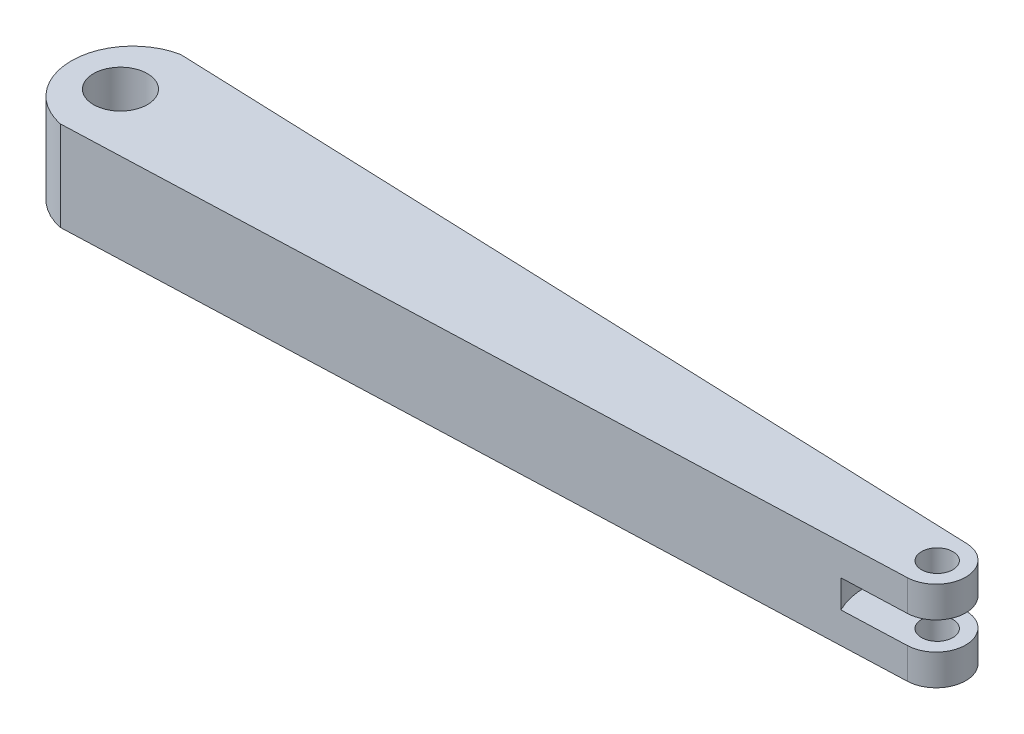
ISO-10303-21;
HEADER;
FILE_DESCRIPTION(('STEP AP214'),'2;1');
FILE_NAME('part.step','',(''),(''),'','','');
FILE_SCHEMA(('AUTOMOTIVE_DESIGN { 1 0 10303 214 1 1 1 1 }'));
ENDSEC;
DATA;
#1=APPLICATION_CONTEXT('core data for automotive mechanical design processes');
#2=APPLICATION_PROTOCOL_DEFINITION('international standard','automotive_design',2000,#1);
#3=PRODUCT_CONTEXT('',#1,'mechanical');
#4=PRODUCT('Part','Part','',(#3));
#5=PRODUCT_RELATED_PRODUCT_CATEGORY('part','',(#4));
#6=PRODUCT_DEFINITION_FORMATION('','',#4);
#7=PRODUCT_DEFINITION_CONTEXT('part definition',#1,'design');
#8=PRODUCT_DEFINITION('design','',#6,#7);
#9=PRODUCT_DEFINITION_SHAPE('','',#8);
#10=(LENGTH_UNIT() NAMED_UNIT(*) SI_UNIT(.MILLI.,.METRE.));
#11=(NAMED_UNIT(*) PLANE_ANGLE_UNIT() SI_UNIT($,.RADIAN.));
#12=(NAMED_UNIT(*) SI_UNIT($,.STERADIAN.) SOLID_ANGLE_UNIT());
#13=UNCERTAINTY_MEASURE_WITH_UNIT(LENGTH_MEASURE(1.E-05),#10,'distance_accuracy_value','');
#14=(GEOMETRIC_REPRESENTATION_CONTEXT(3) GLOBAL_UNCERTAINTY_ASSIGNED_CONTEXT((#13)) GLOBAL_UNIT_ASSIGNED_CONTEXT((#10,
#11,#12)) REPRESENTATION_CONTEXT('',''));
#15=CARTESIAN_POINT('',(0.,0.,0.));
#16=DIRECTION('',(0.,0.,1.));
#17=DIRECTION('',(1.,0.,0.));
#18=AXIS2_PLACEMENT_3D('',#15,#16,#17);
#19=CARTESIAN_POINT('',(66.8275229688345,10.,0.));
#20=DIRECTION('',(0.,-1.,0.));
#21=DIRECTION('',(0.,0.,-1.));
#22=AXIS2_PLACEMENT_3D('',#19,#20,#21);
#23=CYLINDRICAL_SURFACE('',#22,3.30230254171901);
#24=DIRECTION('',(0.,-1.,0.));
#25=VECTOR('',#24,1.);
#26=CARTESIAN_POINT('',(66.9508196721312,10.,3.3));
#27=LINE('',#26,#25);
#28=CARTESIAN_POINT('',(66.9508196721312,10.,3.3));
#29=VERTEX_POINT('',#28);
#30=CARTESIAN_POINT('',(66.9508196721312,6.55,3.3));
#31=VERTEX_POINT('',#30);
#32=EDGE_CURVE('E174',#29,#31,#27,.T.);
#33=ORIENTED_EDGE('',*,*,#32,.T.);
#34=CARTESIAN_POINT('',(66.8275229688345,6.55,0.));
#35=DIRECTION('',(0.,1.,0.));
#36=DIRECTION('',(0.,0.,1.));
#37=AXIS2_PLACEMENT_3D('',#34,#35,#36);
#38=CIRCLE('',#37,3.30230254171901);
#39=CARTESIAN_POINT('',(66.9508196721312,6.55,-3.3));
#40=VERTEX_POINT('',#39);
#41=EDGE_CURVE('E138',#31,#40,#38,.T.);
#42=ORIENTED_EDGE('',*,*,#41,.T.);
#43=DIRECTION('',(0.,-1.,0.));
#44=VECTOR('',#43,1.);
#45=CARTESIAN_POINT('',(66.9508196721312,10.,-3.3));
#46=LINE('',#45,#44);
#47=CARTESIAN_POINT('',(66.9508196721312,10.,-3.3));
#48=VERTEX_POINT('',#47);
#49=EDGE_CURVE('E171',#48,#40,#46,.T.);
#50=ORIENTED_EDGE('',*,*,#49,.F.);
#51=CARTESIAN_POINT('',(66.8275229688345,10.,0.));
#52=DIRECTION('',(0.,1.,0.));
#53=DIRECTION('',(0.,0.,-1.));
#54=AXIS2_PLACEMENT_3D('',#51,#52,#53);
#55=CIRCLE('',#54,3.30230254171901);
#56=EDGE_CURVE('E157',#29,#48,#55,.T.);
#57=ORIENTED_EDGE('',*,*,#56,.F.);
#58=EDGE_LOOP('',(#33,#42,#50,#57));
#59=FACE_BOUND('',#58,.T.);
#60=ADVANCED_FACE('F35',(#59),#23,.T.);
#61=CARTESIAN_POINT('',(66.9508196721312,10.,0.));
#62=DIRECTION('',(0.,-1.,0.));
#63=DIRECTION('',(0.,0.,-1.));
#64=AXIS2_PLACEMENT_3D('',#61,#62,#63);
#65=CYLINDRICAL_SURFACE('',#64,1.75);
#66=CARTESIAN_POINT('',(66.9508196721312,6.55,0.));
#67=DIRECTION('',(0.,1.,0.));
#68=DIRECTION('',(0.,0.,1.));
#69=AXIS2_PLACEMENT_3D('',#66,#67,#68);
#70=CIRCLE('',#69,1.75);
#71=CARTESIAN_POINT('',(66.9508196721312,6.55,1.75));
#72=VERTEX_POINT('',#71);
#73=EDGE_CURVE('E129',#72,#72,#70,.T.);
#74=ORIENTED_EDGE('',*,*,#73,.F.);
#75=EDGE_LOOP('',(#74));
#76=FACE_BOUND('',#75,.T.);
#77=CARTESIAN_POINT('',(66.9508196721312,10.,0.));
#78=DIRECTION('',(0.,1.,0.));
#79=DIRECTION('',(0.,0.,1.));
#80=AXIS2_PLACEMENT_3D('',#77,#78,#79);
#81=CIRCLE('',#80,1.75);
#82=CARTESIAN_POINT('',(66.9508196721312,10.,1.75));
#83=VERTEX_POINT('',#82);
#84=EDGE_CURVE('E148',#83,#83,#81,.T.);
#85=ORIENTED_EDGE('',*,*,#84,.T.);
#86=EDGE_LOOP('',(#85));
#87=FACE_BOUND('',#86,.T.);
#88=ADVANCED_FACE('F211',(#76,#87),#65,.F.);
#89=CARTESIAN_POINT('',(-22.6836095250133,10.,0.));
#90=DIRECTION('',(0.,1.,0.));
#91=DIRECTION('',(0.,0.,1.));
#92=AXIS2_PLACEMENT_3D('',#89,#90,#91);
#93=PLANE('',#92);
#94=ORIENTED_EDGE('',*,*,#84,.F.);
#95=EDGE_LOOP('',(#94));
#96=FACE_BOUND('',#95,.T.);
#97=CARTESIAN_POINT('',(-22.6836095250133,10.,0.));
#98=DIRECTION('',(0.,1.,0.));
#99=DIRECTION('',(0.,0.,1.));
#100=AXIS2_PLACEMENT_3D('',#97,#98,#99);
#101=CIRCLE('',#100,6.83774696940531);
#102=CARTESIAN_POINT('',(-24.0491803278688,10.,-6.7));
#103=VERTEX_POINT('',#102);
#104=CARTESIAN_POINT('',(-24.0491803278688,10.,6.7));
#105=VERTEX_POINT('',#104);
#106=EDGE_CURVE('E154',#103,#105,#101,.T.);
#107=ORIENTED_EDGE('',*,*,#106,.T.);
#108=DIRECTION('',(0.999302746586686,0.,-0.0373365861362058));
#109=VECTOR('',#108,1.);
#110=CARTESIAN_POINT('',(-24.0491803278688,10.,6.7));
#111=LINE('',#110,#109);
#112=EDGE_CURVE('E87',#105,#29,#111,.T.);
#113=ORIENTED_EDGE('',*,*,#112,.T.);
#114=ORIENTED_EDGE('',*,*,#56,.T.);
#115=DIRECTION('',(-0.999302746586686,0.,-0.0373365861362058));
#116=VECTOR('',#115,1.);
#117=CARTESIAN_POINT('',(-24.0491803278688,10.,-6.7));
#118=LINE('',#117,#116);
#119=EDGE_CURVE('E59',#48,#103,#118,.T.);
#120=ORIENTED_EDGE('',*,*,#119,.T.);
#121=EDGE_LOOP('',(#107,#113,#114,#120));
#122=FACE_BOUND('',#121,.T.);
#123=CARTESIAN_POINT('',(-24.0491803278688,10.,0.));
#124=DIRECTION('',(0.,1.,0.));
#125=DIRECTION('',(0.,0.,1.));
#126=AXIS2_PLACEMENT_3D('',#123,#124,#125);
#127=CIRCLE('',#126,3.);
#128=CARTESIAN_POINT('',(-24.0491803278688,10.,3.));
#129=VERTEX_POINT('',#128);
#130=EDGE_CURVE('E142',#129,#129,#127,.T.);
#131=ORIENTED_EDGE('',*,*,#130,.F.);
#132=EDGE_LOOP('',(#131));
#133=FACE_BOUND('',#132,.T.);
#134=ADVANCED_FACE('F189',(#96,#122,#133),#93,.T.);
#135=CARTESIAN_POINT('',(-22.6836095250133,0.,0.));
#136=DIRECTION('',(0.,1.,0.));
#137=DIRECTION('',(0.,0.,1.));
#138=AXIS2_PLACEMENT_3D('',#135,#136,#137);
#139=PLANE('',#138);
#140=CARTESIAN_POINT('',(-22.6836095250133,0.,0.));
#141=DIRECTION('',(0.,1.,0.));
#142=DIRECTION('',(0.,0.,1.));
#143=AXIS2_PLACEMENT_3D('',#140,#141,#142);
#144=CIRCLE('',#143,6.83774696940531);
#145=CARTESIAN_POINT('',(-24.0491803278688,0.,-6.7));
#146=VERTEX_POINT('',#145);
#147=CARTESIAN_POINT('',(-24.0491803278688,0.,6.7));
#148=VERTEX_POINT('',#147);
#149=EDGE_CURVE('E151',#146,#148,#144,.T.);
#150=ORIENTED_EDGE('',*,*,#149,.F.);
#151=DIRECTION('',(-0.999302746586686,0.,-0.0373365861362058));
#152=VECTOR('',#151,1.);
#153=CARTESIAN_POINT('',(-24.0491803278688,0.,-6.7));
#154=LINE('',#153,#152);
#155=CARTESIAN_POINT('',(66.9508196721312,0.,-3.3));
#156=VERTEX_POINT('',#155);
#157=EDGE_CURVE('E79',#156,#146,#154,.T.);
#158=ORIENTED_EDGE('',*,*,#157,.F.);
#159=CARTESIAN_POINT('',(66.8275229688345,0.,0.));
#160=DIRECTION('',(0.,1.,0.));
#161=DIRECTION('',(0.,0.,-1.));
#162=AXIS2_PLACEMENT_3D('',#159,#160,#161);
#163=CIRCLE('',#162,3.30230254171901);
#164=CARTESIAN_POINT('',(66.9508196721312,0.,3.3));
#165=VERTEX_POINT('',#164);
#166=EDGE_CURVE('E165',#165,#156,#163,.T.);
#167=ORIENTED_EDGE('',*,*,#166,.F.);
#168=DIRECTION('',(0.999302746586686,0.,-0.0373365861362058));
#169=VECTOR('',#168,1.);
#170=CARTESIAN_POINT('',(-24.0491803278688,0.,6.7));
#171=LINE('',#170,#169);
#172=EDGE_CURVE('E163',#148,#165,#171,.T.);
#173=ORIENTED_EDGE('',*,*,#172,.F.);
#174=EDGE_LOOP('',(#150,#158,#167,#173));
#175=FACE_BOUND('',#174,.T.);
#176=CARTESIAN_POINT('',(66.9508196721312,0.,0.));
#177=DIRECTION('',(0.,1.,0.));
#178=DIRECTION('',(0.,0.,1.));
#179=AXIS2_PLACEMENT_3D('',#176,#177,#178);
#180=CIRCLE('',#179,1.75);
#181=CARTESIAN_POINT('',(66.9508196721312,0.,1.75));
#182=VERTEX_POINT('',#181);
#183=EDGE_CURVE('E145',#182,#182,#180,.T.);
#184=ORIENTED_EDGE('',*,*,#183,.T.);
#185=EDGE_LOOP('',(#184));
#186=FACE_BOUND('',#185,.T.);
#187=CARTESIAN_POINT('',(-24.0491803278688,0.,0.));
#188=DIRECTION('',(0.,1.,0.));
#189=DIRECTION('',(0.,0.,1.));
#190=AXIS2_PLACEMENT_3D('',#187,#188,#189);
#191=CIRCLE('',#190,3.);
#192=CARTESIAN_POINT('',(-24.0491803278688,0.,3.));
#193=VERTEX_POINT('',#192);
#194=EDGE_CURVE('E118',#193,#193,#191,.T.);
#195=ORIENTED_EDGE('',*,*,#194,.T.);
#196=EDGE_LOOP('',(#195));
#197=FACE_BOUND('',#196,.T.);
#198=ADVANCED_FACE('F197',(#175,#186,#197),#139,.F.);
#199=CARTESIAN_POINT('',(-22.6836095250133,10.,0.));
#200=DIRECTION('',(0.,-1.,0.));
#201=DIRECTION('',(0.,0.,-1.));
#202=AXIS2_PLACEMENT_3D('',#199,#200,#201);
#203=CYLINDRICAL_SURFACE('',#202,6.83774696940531);
#204=ORIENTED_EDGE('',*,*,#149,.T.);
#205=DIRECTION('',(0.,-1.,0.));
#206=VECTOR('',#205,1.);
#207=CARTESIAN_POINT('',(-24.0491803278688,10.,6.7));
#208=LINE('',#207,#206);
#209=EDGE_CURVE('E43',#105,#148,#208,.T.);
#210=ORIENTED_EDGE('',*,*,#209,.F.);
#211=ORIENTED_EDGE('',*,*,#106,.F.);
#212=DIRECTION('',(0.,-1.,0.));
#213=VECTOR('',#212,1.);
#214=CARTESIAN_POINT('',(-24.0491803278688,10.,-6.7));
#215=LINE('',#214,#213);
#216=EDGE_CURVE('E160',#103,#146,#215,.T.);
#217=ORIENTED_EDGE('',*,*,#216,.T.);
#218=EDGE_LOOP('',(#204,#210,#211,#217));
#219=FACE_BOUND('',#218,.T.);
#220=ADVANCED_FACE('F37',(#219),#203,.T.);
#221=CARTESIAN_POINT('',(-24.0491803278688,10.,6.7));
#222=DIRECTION('',(-0.0373365861362058,0.,-0.999302746586686));
#223=DIRECTION('',(-0.999302746586686,0.,0.0373365861362058));
#224=AXIS2_PLACEMENT_3D('',#221,#222,#223);
#225=PLANE('',#224);
#226=DIRECTION('',(0.,-1.,0.));
#227=VECTOR('',#226,1.);
#228=CARTESIAN_POINT('',(59.79032429266,3.45,3.56753499220002));
#229=LINE('',#228,#227);
#230=CARTESIAN_POINT('',(59.79032429266,3.45,3.56753499220002));
#231=VERTEX_POINT('',#230);
#232=CARTESIAN_POINT('',(59.79032429266,6.55,3.56753499220003));
#233=VERTEX_POINT('',#232);
#234=EDGE_CURVE('E110',#231,#233,#229,.F.);
#235=ORIENTED_EDGE('',*,*,#234,.T.);
#236=DIRECTION('',(0.999302746586686,0.,-0.0373365861362058));
#237=VECTOR('',#236,1.);
#238=CARTESIAN_POINT('',(-24.0491803278688,6.55,6.7));
#239=LINE('',#238,#237);
#240=EDGE_CURVE('E119',#233,#31,#239,.T.);
#241=ORIENTED_EDGE('',*,*,#240,.T.);
#242=ORIENTED_EDGE('',*,*,#32,.F.);
#243=ORIENTED_EDGE('',*,*,#112,.F.);
#244=ORIENTED_EDGE('',*,*,#209,.T.);
#245=ORIENTED_EDGE('',*,*,#172,.T.);
#246=CARTESIAN_POINT('',(66.9508196721312,3.45,3.3));
#247=VERTEX_POINT('',#246);
#248=EDGE_CURVE('E128',#247,#165,#27,.T.);
#249=ORIENTED_EDGE('',*,*,#248,.F.);
#250=DIRECTION('',(-0.999302746586686,0.,0.0373365861362058));
#251=VECTOR('',#250,1.);
#252=CARTESIAN_POINT('',(-24.0491803278688,3.45,6.7));
#253=LINE('',#252,#251);
#254=EDGE_CURVE('E122',#247,#231,#253,.T.);
#255=ORIENTED_EDGE('',*,*,#254,.T.);
#256=EDGE_LOOP('',(#235,#241,#242,#243,#244,#245,#249,#255));
#257=FACE_BOUND('',#256,.T.);
#258=ADVANCED_FACE('F126',(#257),#225,.F.);
#259=CARTESIAN_POINT('',(66.9508196721312,3.45,-3.3));
#260=VERTEX_POINT('',#259);
#261=EDGE_CURVE('E170',#260,#156,#46,.T.);
#262=ORIENTED_EDGE('',*,*,#261,.F.);
#263=CARTESIAN_POINT('',(66.8275229688345,3.45,0.));
#264=DIRECTION('',(0.,-1.,0.));
#265=DIRECTION('',(0.,0.,-1.));
#266=AXIS2_PLACEMENT_3D('',#263,#264,#265);
#267=CIRCLE('',#266,3.30230254171901);
#268=EDGE_CURVE('E50',#260,#247,#267,.T.);
#269=ORIENTED_EDGE('',*,*,#268,.T.);
#270=ORIENTED_EDGE('',*,*,#248,.T.);
#271=ORIENTED_EDGE('',*,*,#166,.T.);
#272=EDGE_LOOP('',(#262,#269,#270,#271));
#273=FACE_BOUND('',#272,.T.);
#274=ADVANCED_FACE('F201',(#273),#23,.T.);
#275=CARTESIAN_POINT('',(-24.0491803278688,10.,-6.7));
#276=DIRECTION('',(-0.0373365861362058,0.,0.999302746586686));
#277=DIRECTION('',(0.999302746586686,0.,0.0373365861362058));
#278=AXIS2_PLACEMENT_3D('',#275,#276,#277);
#279=PLANE('',#278);
#280=ORIENTED_EDGE('',*,*,#49,.T.);
#281=DIRECTION('',(-0.999302746586686,0.,-0.0373365861362058));
#282=VECTOR('',#281,1.);
#283=CARTESIAN_POINT('',(-24.0491803278688,6.55,-6.7));
#284=LINE('',#283,#282);
#285=CARTESIAN_POINT('',(59.79032429266,6.55,-3.56753499220003));
#286=VERTEX_POINT('',#285);
#287=EDGE_CURVE('E132',#40,#286,#284,.T.);
#288=ORIENTED_EDGE('',*,*,#287,.T.);
#289=DIRECTION('',(0.,-1.,0.));
#290=VECTOR('',#289,1.);
#291=CARTESIAN_POINT('',(59.79032429266,3.45,-3.56753499220002));
#292=LINE('',#291,#290);
#293=CARTESIAN_POINT('',(59.79032429266,3.45,-3.56753499220002));
#294=VERTEX_POINT('',#293);
#295=EDGE_CURVE('E11',#286,#294,#292,.T.);
#296=ORIENTED_EDGE('',*,*,#295,.T.);
#297=DIRECTION('',(0.999302746586686,0.,0.0373365861362058));
#298=VECTOR('',#297,1.);
#299=CARTESIAN_POINT('',(-24.0491803278688,3.45,-6.7));
#300=LINE('',#299,#298);
#301=EDGE_CURVE('E123',#294,#260,#300,.T.);
#302=ORIENTED_EDGE('',*,*,#301,.T.);
#303=ORIENTED_EDGE('',*,*,#261,.T.);
#304=ORIENTED_EDGE('',*,*,#157,.T.);
#305=ORIENTED_EDGE('',*,*,#216,.F.);
#306=ORIENTED_EDGE('',*,*,#119,.F.);
#307=EDGE_LOOP('',(#280,#288,#296,#302,#303,#304,#305,#306));
#308=FACE_BOUND('',#307,.T.);
#309=ADVANCED_FACE('F185',(#308),#279,.F.);
#310=CARTESIAN_POINT('',(66.9508196721312,3.45,0.));
#311=DIRECTION('',(0.,-1.,0.));
#312=DIRECTION('',(0.,0.,-1.));
#313=AXIS2_PLACEMENT_3D('',#310,#311,#312);
#314=CIRCLE('',#313,1.75);
#315=CARTESIAN_POINT('',(66.9508196721312,3.45,-1.75));
#316=VERTEX_POINT('',#315);
#317=EDGE_CURVE('E178',#316,#316,#314,.T.);
#318=ORIENTED_EDGE('',*,*,#317,.F.);
#319=EDGE_LOOP('',(#318));
#320=FACE_BOUND('',#319,.T.);
#321=ORIENTED_EDGE('',*,*,#183,.F.);
#322=EDGE_LOOP('',(#321));
#323=FACE_BOUND('',#322,.T.);
#324=ADVANCED_FACE('F208',(#320,#323),#65,.F.);
#325=CARTESIAN_POINT('',(-24.0491803278688,10.,0.));
#326=DIRECTION('',(0.,-1.,0.));
#327=DIRECTION('',(0.,0.,-1.));
#328=AXIS2_PLACEMENT_3D('',#325,#326,#327);
#329=CYLINDRICAL_SURFACE('',#328,3.);
#330=ORIENTED_EDGE('',*,*,#130,.T.);
#331=EDGE_LOOP('',(#330));
#332=FACE_BOUND('',#331,.T.);
#333=ORIENTED_EDGE('',*,*,#194,.F.);
#334=EDGE_LOOP('',(#333));
#335=FACE_BOUND('',#334,.T.);
#336=ADVANCED_FACE('F226',(#332,#335),#329,.F.);
#337=CARTESIAN_POINT('',(66.9508196721312,3.45,0.));
#338=DIRECTION('',(0.,-1.,0.));
#339=DIRECTION('',(0.,0.,-1.));
#340=AXIS2_PLACEMENT_3D('',#337,#338,#339);
#341=CYLINDRICAL_SURFACE('',#340,8.);
#342=CARTESIAN_POINT('',(66.9508196721312,3.45,0.));
#343=DIRECTION('',(0.,-1.,0.));
#344=DIRECTION('',(0.,0.,-1.));
#345=AXIS2_PLACEMENT_3D('',#342,#343,#344);
#346=CIRCLE('',#345,8.);
#347=EDGE_CURVE('E113',#231,#294,#346,.T.);
#348=ORIENTED_EDGE('',*,*,#347,.T.);
#349=ORIENTED_EDGE('',*,*,#295,.F.);
#350=CARTESIAN_POINT('',(66.9508196721312,6.55,0.));
#351=DIRECTION('',(0.,-1.,0.));
#352=DIRECTION('',(0.,0.,-1.));
#353=AXIS2_PLACEMENT_3D('',#350,#351,#352);
#354=CIRCLE('',#353,8.);
#355=EDGE_CURVE('E115',#233,#286,#354,.T.);
#356=ORIENTED_EDGE('',*,*,#355,.F.);
#357=ORIENTED_EDGE('',*,*,#234,.F.);
#358=EDGE_LOOP('',(#348,#349,#356,#357));
#359=FACE_BOUND('',#358,.T.);
#360=ADVANCED_FACE('F112',(#359),#341,.F.);
#361=CARTESIAN_POINT('',(66.9508196721312,6.55,0.));
#362=DIRECTION('',(0.,1.,0.));
#363=DIRECTION('',(0.,0.,1.));
#364=AXIS2_PLACEMENT_3D('',#361,#362,#363);
#365=PLANE('',#364);
#366=ORIENTED_EDGE('',*,*,#73,.T.);
#367=EDGE_LOOP('',(#366));
#368=FACE_BOUND('',#367,.T.);
#369=ORIENTED_EDGE('',*,*,#355,.T.);
#370=ORIENTED_EDGE('',*,*,#287,.F.);
#371=ORIENTED_EDGE('',*,*,#41,.F.);
#372=ORIENTED_EDGE('',*,*,#240,.F.);
#373=EDGE_LOOP('',(#369,#370,#371,#372));
#374=FACE_BOUND('',#373,.T.);
#375=ADVANCED_FACE('F184',(#368,#374),#365,.F.);
#376=CARTESIAN_POINT('',(66.9508196721312,3.45,-8.));
#377=DIRECTION('',(0.,-1.,0.));
#378=DIRECTION('',(0.,0.,-1.));
#379=AXIS2_PLACEMENT_3D('',#376,#377,#378);
#380=PLANE('',#379);
#381=ORIENTED_EDGE('',*,*,#317,.T.);
#382=EDGE_LOOP('',(#381));
#383=FACE_BOUND('',#382,.T.);
#384=ORIENTED_EDGE('',*,*,#268,.F.);
#385=ORIENTED_EDGE('',*,*,#301,.F.);
#386=ORIENTED_EDGE('',*,*,#347,.F.);
#387=ORIENTED_EDGE('',*,*,#254,.F.);
#388=EDGE_LOOP('',(#384,#385,#386,#387));
#389=FACE_BOUND('',#388,.T.);
#390=ADVANCED_FACE('F121',(#383,#389),#380,.F.);
#391=CLOSED_SHELL('',(#60,#88,#134,#198,#220,#258,#274,#309,#324,#336,#360,#375,#390));
#392=MANIFOLD_SOLID_BREP('B2',#391);
#393=ADVANCED_BREP_SHAPE_REPRESENTATION('',(#18,#392),#14);
#394=SHAPE_DEFINITION_REPRESENTATION(#9,#393);
ENDSEC;
END-ISO-10303-21;
